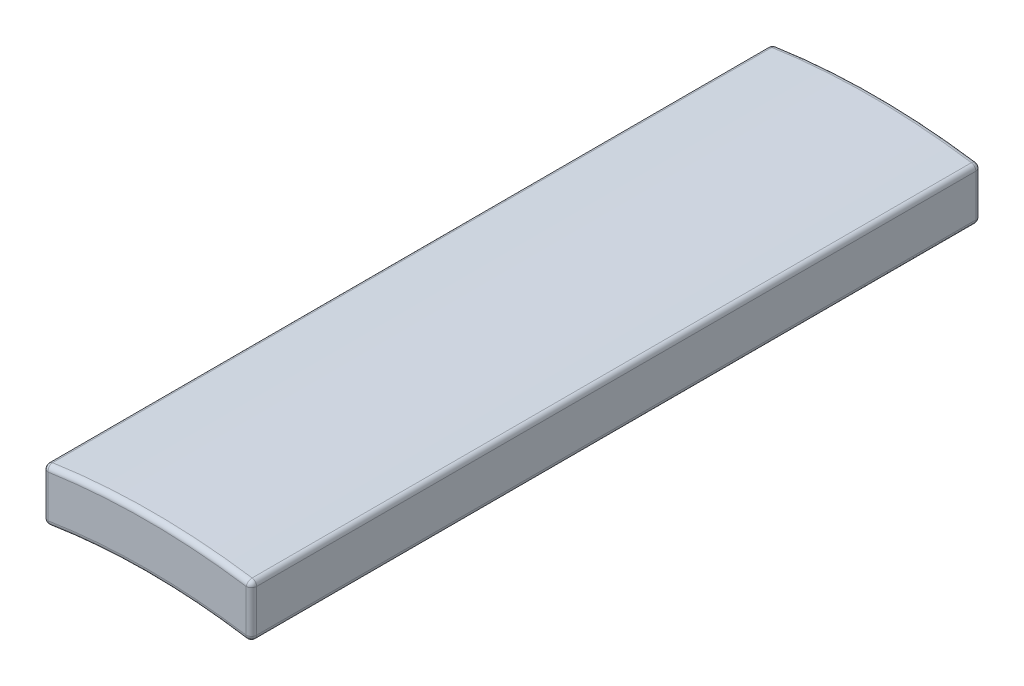
ISO-10303-21;
HEADER;
FILE_DESCRIPTION(('STEP AP214'),'2;1');
FILE_NAME('part.step','',(''),(''),'','','');
FILE_SCHEMA(('AUTOMOTIVE_DESIGN { 1 0 10303 214 1 1 1 1 }'));
ENDSEC;
DATA;
#1=APPLICATION_CONTEXT('core data for automotive mechanical design processes');
#2=APPLICATION_PROTOCOL_DEFINITION('international standard','automotive_design',2000,#1);
#3=PRODUCT_CONTEXT('',#1,'mechanical');
#4=PRODUCT('Part','Part','',(#3));
#5=PRODUCT_RELATED_PRODUCT_CATEGORY('part','',(#4));
#6=PRODUCT_DEFINITION_FORMATION('','',#4);
#7=PRODUCT_DEFINITION_CONTEXT('part definition',#1,'design');
#8=PRODUCT_DEFINITION('design','',#6,#7);
#9=PRODUCT_DEFINITION_SHAPE('','',#8);
#10=(LENGTH_UNIT() NAMED_UNIT(*) SI_UNIT(.MILLI.,.METRE.));
#11=(NAMED_UNIT(*) PLANE_ANGLE_UNIT() SI_UNIT($,.RADIAN.));
#12=(NAMED_UNIT(*) SI_UNIT($,.STERADIAN.) SOLID_ANGLE_UNIT());
#13=UNCERTAINTY_MEASURE_WITH_UNIT(LENGTH_MEASURE(1.E-05),#10,'distance_accuracy_value','');
#14=(GEOMETRIC_REPRESENTATION_CONTEXT(3) GLOBAL_UNCERTAINTY_ASSIGNED_CONTEXT((#13)) GLOBAL_UNIT_ASSIGNED_CONTEXT((#10,
#11,#12)) REPRESENTATION_CONTEXT('',''));
#15=CARTESIAN_POINT('',(0.,0.,0.));
#16=DIRECTION('',(0.,0.,1.));
#17=DIRECTION('',(1.,0.,0.));
#18=AXIS2_PLACEMENT_3D('',#15,#16,#17);
#19=CARTESIAN_POINT('',(0.,0.,14.));
#20=DIRECTION('',(0.,0.,-1.));
#21=DIRECTION('',(-1.,0.,0.));
#22=AXIS2_PLACEMENT_3D('',#19,#20,#21);
#23=CYLINDRICAL_SURFACE('',#22,12.);
#24=CARTESIAN_POINT('',(0.,0.,0.0999999999999994));
#25=DIRECTION('',(0.,0.,1.));
#26=DIRECTION('',(1.,0.,0.));
#27=AXIS2_PLACEMENT_3D('',#24,#25,#26);
#28=CIRCLE('',#27,12.);
#29=CARTESIAN_POINT('',(-1.88429752066116,11.8511359309406,0.0999999999999994));
#30=VERTEX_POINT('',#29);
#31=CARTESIAN_POINT('',(1.88429752066116,11.8511359309406,0.0999999999999994));
#32=VERTEX_POINT('',#31);
#33=EDGE_CURVE('E44',#30,#32,#28,.F.);
#34=ORIENTED_EDGE('',*,*,#33,.T.);
#35=DIRECTION('',(0.,0.,-1.));
#36=VECTOR('',#35,1.);
#37=CARTESIAN_POINT('',(1.88429752066116,11.8511359309406,14.));
#38=LINE('',#37,#36);
#39=CARTESIAN_POINT('',(1.88429752066116,11.8511359309406,13.9));
#40=VERTEX_POINT('',#39);
#41=EDGE_CURVE('E11',#32,#40,#38,.F.);
#42=ORIENTED_EDGE('',*,*,#41,.T.);
#43=CARTESIAN_POINT('',(0.,0.,13.9));
#44=DIRECTION('',(0.,0.,1.));
#45=DIRECTION('',(1.,0.,0.));
#46=AXIS2_PLACEMENT_3D('',#43,#44,#45);
#47=CIRCLE('',#46,12.);
#48=CARTESIAN_POINT('',(-1.88429752066116,11.8511359309406,13.9));
#49=VERTEX_POINT('',#48);
#50=EDGE_CURVE('E203',#40,#49,#47,.T.);
#51=ORIENTED_EDGE('',*,*,#50,.T.);
#52=DIRECTION('',(0.,0.,-1.));
#53=VECTOR('',#52,1.);
#54=CARTESIAN_POINT('',(-1.88429752066116,11.8511359309406,14.));
#55=LINE('',#54,#53);
#56=EDGE_CURVE('E201',#49,#30,#55,.T.);
#57=ORIENTED_EDGE('',*,*,#56,.T.);
#58=EDGE_LOOP('',(#34,#42,#51,#57));
#59=FACE_BOUND('',#58,.T.);
#60=ADVANCED_FACE('F35',(#59),#23,.F.);
#61=CARTESIAN_POINT('',(2.,11.8321595661992,14.));
#62=DIRECTION('',(-1.,0.,0.));
#63=DIRECTION('',(0.,0.,1.));
#64=AXIS2_PLACEMENT_3D('',#61,#62,#63);
#65=PLANE('',#64);
#66=DIRECTION('',(0.,1.,0.));
#67=VECTOR('',#66,1.);
#68=CARTESIAN_POINT('',(2.,11.8321595661992,0.0999999999999994));
#69=LINE('',#68,#67);
#70=CARTESIAN_POINT('',(2.,11.9498953970317,0.0999999999999994));
#71=VERTEX_POINT('',#70);
#72=CARTESIAN_POINT('',(2.,12.7593103261893,0.0999999999999994));
#73=VERTEX_POINT('',#72);
#74=EDGE_CURVE('E169',#71,#73,#69,.T.);
#75=ORIENTED_EDGE('',*,*,#74,.T.);
#76=DIRECTION('',(0.,0.,-1.));
#77=VECTOR('',#76,1.);
#78=CARTESIAN_POINT('',(2.,12.7593103261893,14.));
#79=LINE('',#78,#77);
#80=CARTESIAN_POINT('',(2.,12.7593103261893,13.9));
#81=VERTEX_POINT('',#80);
#82=EDGE_CURVE('E174',#73,#81,#79,.F.);
#83=ORIENTED_EDGE('',*,*,#82,.T.);
#84=DIRECTION('',(0.,1.,0.));
#85=VECTOR('',#84,1.);
#86=CARTESIAN_POINT('',(2.,11.8321595661992,13.9));
#87=LINE('',#86,#85);
#88=CARTESIAN_POINT('',(2.,11.9498953970317,13.9));
#89=VERTEX_POINT('',#88);
#90=EDGE_CURVE('E171',#81,#89,#87,.F.);
#91=ORIENTED_EDGE('',*,*,#90,.T.);
#92=DIRECTION('',(0.,0.,-1.));
#93=VECTOR('',#92,1.);
#94=CARTESIAN_POINT('',(2.,11.9498953970317,14.));
#95=LINE('',#94,#93);
#96=EDGE_CURVE('E167',#89,#71,#95,.T.);
#97=ORIENTED_EDGE('',*,*,#96,.T.);
#98=EDGE_LOOP('',(#75,#83,#91,#97));
#99=FACE_BOUND('',#98,.T.);
#100=ADVANCED_FACE('F286',(#99),#65,.F.);
#101=CARTESIAN_POINT('',(0.,0.,14.));
#102=DIRECTION('',(0.,0.,-1.));
#103=DIRECTION('',(-1.,0.,0.));
#104=AXIS2_PLACEMENT_3D('',#101,#102,#103);
#105=CYLINDRICAL_SURFACE('',#104,13.);
#106=CARTESIAN_POINT('',(0.,0.,13.9));
#107=DIRECTION('',(0.,0.,1.));
#108=DIRECTION('',(1.,0.,0.));
#109=AXIS2_PLACEMENT_3D('',#106,#107,#108);
#110=CIRCLE('',#109,13.);
#111=CARTESIAN_POINT('',(-1.91472868217054,12.8582197085628,13.9));
#112=VERTEX_POINT('',#111);
#113=CARTESIAN_POINT('',(1.91472868217054,12.8582197085628,13.9));
#114=VERTEX_POINT('',#113);
#115=EDGE_CURVE('E194',#112,#114,#110,.F.);
#116=ORIENTED_EDGE('',*,*,#115,.T.);
#117=DIRECTION('',(0.,0.,-1.));
#118=VECTOR('',#117,1.);
#119=CARTESIAN_POINT('',(1.91472868217054,12.8582197085628,14.));
#120=LINE('',#119,#118);
#121=CARTESIAN_POINT('',(1.91472868217054,12.8582197085628,0.0999999999999994));
#122=VERTEX_POINT('',#121);
#123=EDGE_CURVE('E199',#114,#122,#120,.T.);
#124=ORIENTED_EDGE('',*,*,#123,.T.);
#125=CARTESIAN_POINT('',(0.,0.,0.0999999999999994));
#126=DIRECTION('',(0.,0.,1.));
#127=DIRECTION('',(1.,0.,0.));
#128=AXIS2_PLACEMENT_3D('',#125,#126,#127);
#129=CIRCLE('',#128,13.);
#130=CARTESIAN_POINT('',(-1.91472868217054,12.8582197085628,0.0999999999999994));
#131=VERTEX_POINT('',#130);
#132=EDGE_CURVE('E196',#122,#131,#129,.T.);
#133=ORIENTED_EDGE('',*,*,#132,.T.);
#134=DIRECTION('',(0.,0.,-1.));
#135=VECTOR('',#134,1.);
#136=CARTESIAN_POINT('',(-1.91472868217054,12.8582197085628,14.));
#137=LINE('',#136,#135);
#138=EDGE_CURVE('E192',#131,#112,#137,.F.);
#139=ORIENTED_EDGE('',*,*,#138,.T.);
#140=EDGE_LOOP('',(#116,#124,#133,#139));
#141=FACE_BOUND('',#140,.T.);
#142=ADVANCED_FACE('F268',(#141),#105,.T.);
#143=CARTESIAN_POINT('',(-2.,11.8321595661992,14.));
#144=DIRECTION('',(1.,0.,0.));
#145=DIRECTION('',(0.,0.,-1.));
#146=AXIS2_PLACEMENT_3D('',#143,#144,#145);
#147=PLANE('',#146);
#148=DIRECTION('',(0.,-1.,0.));
#149=VECTOR('',#148,1.);
#150=CARTESIAN_POINT('',(-2.,12.8452325786651,13.9));
#151=LINE('',#150,#149);
#152=CARTESIAN_POINT('',(-2.,11.9498953970317,13.9));
#153=VERTEX_POINT('',#152);
#154=CARTESIAN_POINT('',(-2.,12.7593103261893,13.9));
#155=VERTEX_POINT('',#154);
#156=EDGE_CURVE('E143',#153,#155,#151,.F.);
#157=ORIENTED_EDGE('',*,*,#156,.T.);
#158=DIRECTION('',(0.,0.,-1.));
#159=VECTOR('',#158,1.);
#160=CARTESIAN_POINT('',(-2.,12.7593103261893,14.));
#161=LINE('',#160,#159);
#162=CARTESIAN_POINT('',(-2.,12.7593103261893,0.0999999999999994));
#163=VERTEX_POINT('',#162);
#164=EDGE_CURVE('E181',#155,#163,#161,.T.);
#165=ORIENTED_EDGE('',*,*,#164,.T.);
#166=DIRECTION('',(0.,-1.,0.));
#167=VECTOR('',#166,1.);
#168=CARTESIAN_POINT('',(-2.,11.8321595661992,0.0999999999999994));
#169=LINE('',#168,#167);
#170=CARTESIAN_POINT('',(-2.,11.9498953970317,0.0999999999999994));
#171=VERTEX_POINT('',#170);
#172=EDGE_CURVE('E178',#163,#171,#169,.T.);
#173=ORIENTED_EDGE('',*,*,#172,.T.);
#174=DIRECTION('',(0.,0.,-1.));
#175=VECTOR('',#174,1.);
#176=CARTESIAN_POINT('',(-2.,11.9498953970317,14.));
#177=LINE('',#176,#175);
#178=EDGE_CURVE('E176',#171,#153,#177,.F.);
#179=ORIENTED_EDGE('',*,*,#178,.T.);
#180=EDGE_LOOP('',(#157,#165,#173,#179));
#181=FACE_BOUND('',#180,.T.);
#182=ADVANCED_FACE('F307',(#181),#147,.F.);
#183=CARTESIAN_POINT('',(0.,0.,14.));
#184=DIRECTION('',(0.,0.,1.));
#185=DIRECTION('',(1.,0.,0.));
#186=AXIS2_PLACEMENT_3D('',#183,#184,#185);
#187=PLANE('',#186);
#188=DIRECTION('',(0.,1.,0.));
#189=VECTOR('',#188,1.);
#190=CARTESIAN_POINT('',(1.9,12.8452325786651,14.));
#191=LINE('',#190,#189);
#192=CARTESIAN_POINT('',(1.9,11.9498953970317,14.));
#193=VERTEX_POINT('',#192);
#194=CARTESIAN_POINT('',(1.9,12.7593103261893,14.));
#195=VERTEX_POINT('',#194);
#196=EDGE_CURVE('E135',#193,#195,#191,.T.);
#197=ORIENTED_EDGE('',*,*,#196,.T.);
#198=CARTESIAN_POINT('',(0.,0.,14.));
#199=DIRECTION('',(0.,0.,1.));
#200=DIRECTION('',(1.,0.,0.));
#201=AXIS2_PLACEMENT_3D('',#198,#199,#200);
#202=CIRCLE('',#201,12.9);
#203=CARTESIAN_POINT('',(-1.9,12.7593103261893,14.));
#204=VERTEX_POINT('',#203);
#205=EDGE_CURVE('E131',#195,#204,#202,.T.);
#206=ORIENTED_EDGE('',*,*,#205,.T.);
#207=DIRECTION('',(0.,-1.,0.));
#208=VECTOR('',#207,1.);
#209=CARTESIAN_POINT('',(-1.9,11.8321595661992,14.));
#210=LINE('',#209,#208);
#211=CARTESIAN_POINT('',(-1.9,11.9498953970317,14.));
#212=VERTEX_POINT('',#211);
#213=EDGE_CURVE('E123',#204,#212,#210,.T.);
#214=ORIENTED_EDGE('',*,*,#213,.T.);
#215=CARTESIAN_POINT('',(0.,0.,14.));
#216=DIRECTION('',(0.,0.,1.));
#217=DIRECTION('',(1.,0.,0.));
#218=AXIS2_PLACEMENT_3D('',#215,#216,#217);
#219=CIRCLE('',#218,12.1);
#220=EDGE_CURVE('E128',#212,#193,#219,.F.);
#221=ORIENTED_EDGE('',*,*,#220,.T.);
#222=EDGE_LOOP('',(#197,#206,#214,#221));
#223=FACE_BOUND('',#222,.T.);
#224=ADVANCED_FACE('F126',(#223),#187,.T.);
#225=CARTESIAN_POINT('',(0.,0.,0.));
#226=DIRECTION('',(0.,0.,1.));
#227=DIRECTION('',(1.,0.,0.));
#228=AXIS2_PLACEMENT_3D('',#225,#226,#227);
#229=PLANE('',#228);
#230=DIRECTION('',(0.,-1.,0.));
#231=VECTOR('',#230,1.);
#232=CARTESIAN_POINT('',(-1.9,0.,0.));
#233=LINE('',#232,#231);
#234=CARTESIAN_POINT('',(-1.9,11.9498953970317,0.));
#235=VERTEX_POINT('',#234);
#236=CARTESIAN_POINT('',(-1.9,12.7593103261893,0.));
#237=VERTEX_POINT('',#236);
#238=EDGE_CURVE('E187',#235,#237,#233,.F.);
#239=ORIENTED_EDGE('',*,*,#238,.T.);
#240=CARTESIAN_POINT('',(0.,0.,0.));
#241=DIRECTION('',(0.,0.,1.));
#242=DIRECTION('',(1.,0.,0.));
#243=AXIS2_PLACEMENT_3D('',#240,#241,#242);
#244=CIRCLE('',#243,12.9);
#245=CARTESIAN_POINT('',(1.9,12.7593103261893,0.));
#246=VERTEX_POINT('',#245);
#247=EDGE_CURVE('E190',#237,#246,#244,.F.);
#248=ORIENTED_EDGE('',*,*,#247,.T.);
#249=DIRECTION('',(0.,1.,0.));
#250=VECTOR('',#249,1.);
#251=CARTESIAN_POINT('',(1.9,0.,0.));
#252=LINE('',#251,#250);
#253=CARTESIAN_POINT('',(1.9,11.9498953970317,0.));
#254=VERTEX_POINT('',#253);
#255=EDGE_CURVE('E185',#246,#254,#252,.F.);
#256=ORIENTED_EDGE('',*,*,#255,.T.);
#257=CARTESIAN_POINT('',(0.,0.,0.));
#258=DIRECTION('',(0.,0.,1.));
#259=DIRECTION('',(1.,0.,0.));
#260=AXIS2_PLACEMENT_3D('',#257,#258,#259);
#261=CIRCLE('',#260,12.1);
#262=EDGE_CURVE('E183',#254,#235,#261,.T.);
#263=ORIENTED_EDGE('',*,*,#262,.T.);
#264=EDGE_LOOP('',(#239,#248,#256,#263));
#265=FACE_BOUND('',#264,.T.);
#266=ADVANCED_FACE('F295',(#265),#229,.F.);
#267=CARTESIAN_POINT('',(-1.9,11.8321595661992,0.0999999999999994));
#268=DIRECTION('',(0.,-1.,0.));
#269=DIRECTION('',(0.,0.,-1.));
#270=AXIS2_PLACEMENT_3D('',#267,#268,#269);
#271=CYLINDRICAL_SURFACE('',#270,0.1);
#272=CARTESIAN_POINT('',(-1.9,11.9498953970317,0.0999999999999994));
#273=DIRECTION('',(0.,-1.,0.));
#274=DIRECTION('',(0.,0.,-1.));
#275=AXIS2_PLACEMENT_3D('',#272,#273,#274);
#276=CIRCLE('',#275,0.1);
#277=EDGE_CURVE('E39',#171,#235,#276,.T.);
#278=ORIENTED_EDGE('',*,*,#277,.F.);
#279=ORIENTED_EDGE('',*,*,#172,.F.);
#280=CARTESIAN_POINT('',(-1.9,12.7593103261893,0.1));
#281=DIRECTION('',(0.,1.,0.));
#282=DIRECTION('',(0.,0.,1.));
#283=AXIS2_PLACEMENT_3D('',#280,#281,#282);
#284=CIRCLE('',#283,0.1);
#285=EDGE_CURVE('E163',#237,#163,#284,.T.);
#286=ORIENTED_EDGE('',*,*,#285,.F.);
#287=ORIENTED_EDGE('',*,*,#238,.F.);
#288=EDGE_LOOP('',(#278,#279,#286,#287));
#289=FACE_BOUND('',#288,.T.);
#290=ADVANCED_FACE('F37',(#289),#271,.T.);
#291=CARTESIAN_POINT('',(-1.9,11.9498953970317,0.1));
#292=DIRECTION('',(0.,0.,1.));
#293=DIRECTION('',(1.,0.,0.));
#294=AXIS2_PLACEMENT_3D('',#291,#292,#293);
#295=SPHERICAL_SURFACE('',#294,0.1);
#296=CARTESIAN_POINT('',(-1.9,11.9498953970317,0.0999999999999994));
#297=DIRECTION('',(0.,0.,-1.));
#298=DIRECTION('',(-1.,0.,0.));
#299=AXIS2_PLACEMENT_3D('',#296,#297,#298);
#300=CIRCLE('',#299,0.1);
#301=EDGE_CURVE('E248',#171,#30,#300,.F.);
#302=ORIENTED_EDGE('',*,*,#301,.F.);
#303=ORIENTED_EDGE('',*,*,#277,.T.);
#304=CARTESIAN_POINT('',(-1.9,11.9498953970317,0.1));
#305=DIRECTION('',(-0.987594660911713,-0.15702479338843,0.));
#306=DIRECTION('',(0.15702479338843,-0.987594660911713,0.));
#307=AXIS2_PLACEMENT_3D('',#304,#305,#306);
#308=CIRCLE('',#307,0.1);
#309=EDGE_CURVE('E251',#30,#235,#308,.F.);
#310=ORIENTED_EDGE('',*,*,#309,.F.);
#311=EDGE_LOOP('',(#302,#303,#310));
#312=FACE_BOUND('',#311,.T.);
#313=ADVANCED_FACE('F303',(#312),#295,.T.);
#314=CARTESIAN_POINT('',(-1.9,12.7593103261893,0.1));
#315=DIRECTION('',(0.,0.,1.));
#316=DIRECTION('',(1.,0.,0.));
#317=AXIS2_PLACEMENT_3D('',#314,#315,#316);
#318=SPHERICAL_SURFACE('',#317,0.1);
#319=CARTESIAN_POINT('',(-1.9,12.7593103261893,0.0999999999999994));
#320=DIRECTION('',(-0.989093823735602,-0.147286821705427,0.));
#321=DIRECTION('',(0.147286821705427,-0.989093823735602,0.));
#322=AXIS2_PLACEMENT_3D('',#319,#320,#321);
#323=CIRCLE('',#322,0.1);
#324=EDGE_CURVE('E242',#237,#131,#323,.F.);
#325=ORIENTED_EDGE('',*,*,#324,.F.);
#326=ORIENTED_EDGE('',*,*,#285,.T.);
#327=CARTESIAN_POINT('',(-1.9,12.7593103261893,0.0999999999999994));
#328=DIRECTION('',(0.,0.,-1.));
#329=DIRECTION('',(-1.,0.,0.));
#330=AXIS2_PLACEMENT_3D('',#327,#328,#329);
#331=CIRCLE('',#330,0.1);
#332=EDGE_CURVE('E245',#131,#163,#331,.F.);
#333=ORIENTED_EDGE('',*,*,#332,.F.);
#334=EDGE_LOOP('',(#325,#326,#333));
#335=FACE_BOUND('',#334,.T.);
#336=ADVANCED_FACE('F258',(#335),#318,.T.);
#337=CARTESIAN_POINT('',(0.,0.,0.0999999999999994));
#338=DIRECTION('',(0.,0.,1.));
#339=DIRECTION('',(1.,0.,0.));
#340=AXIS2_PLACEMENT_3D('',#337,#338,#339);
#341=TOROIDAL_SURFACE('',#340,12.1,0.1);
#342=ORIENTED_EDGE('',*,*,#309,.T.);
#343=ORIENTED_EDGE('',*,*,#262,.F.);
#344=CARTESIAN_POINT('',(1.9,11.9498953970317,0.0999999999999994));
#345=DIRECTION('',(0.987594660911713,-0.15702479338843,0.));
#346=DIRECTION('',(0.15702479338843,0.987594660911713,0.));
#347=AXIS2_PLACEMENT_3D('',#344,#345,#346);
#348=CIRCLE('',#347,0.1);
#349=EDGE_CURVE('E236',#32,#254,#348,.T.);
#350=ORIENTED_EDGE('',*,*,#349,.F.);
#351=ORIENTED_EDGE('',*,*,#33,.F.);
#352=EDGE_LOOP('',(#342,#343,#350,#351));
#353=FACE_BOUND('',#352,.T.);
#354=ADVANCED_FACE('F298',(#353),#341,.T.);
#355=CARTESIAN_POINT('',(-1.9,11.9498953970317,14.));
#356=DIRECTION('',(0.,0.,-1.));
#357=DIRECTION('',(-1.,0.,0.));
#358=AXIS2_PLACEMENT_3D('',#355,#356,#357);
#359=CYLINDRICAL_SURFACE('',#358,0.1);
#360=ORIENTED_EDGE('',*,*,#301,.T.);
#361=ORIENTED_EDGE('',*,*,#56,.F.);
#362=CARTESIAN_POINT('',(-1.9,11.9498953970317,13.9));
#363=DIRECTION('',(0.,0.,1.));
#364=DIRECTION('',(1.,0.,0.));
#365=AXIS2_PLACEMENT_3D('',#362,#363,#364);
#366=CIRCLE('',#365,0.1);
#367=EDGE_CURVE('E147',#153,#49,#366,.T.);
#368=ORIENTED_EDGE('',*,*,#367,.F.);
#369=ORIENTED_EDGE('',*,*,#178,.F.);
#370=EDGE_LOOP('',(#360,#361,#368,#369));
#371=FACE_BOUND('',#370,.T.);
#372=ADVANCED_FACE('F309',(#371),#359,.T.);
#373=CARTESIAN_POINT('',(-1.9,0.,13.9));
#374=DIRECTION('',(0.,1.,0.));
#375=DIRECTION('',(0.,0.,1.));
#376=AXIS2_PLACEMENT_3D('',#373,#374,#375);
#377=CYLINDRICAL_SURFACE('',#376,0.1);
#378=CARTESIAN_POINT('',(-1.9,12.7593103261893,13.9));
#379=DIRECTION('',(0.,1.,0.));
#380=DIRECTION('',(0.,0.,1.));
#381=AXIS2_PLACEMENT_3D('',#378,#379,#380);
#382=CIRCLE('',#381,0.1);
#383=EDGE_CURVE('E148',#155,#204,#382,.T.);
#384=ORIENTED_EDGE('',*,*,#383,.F.);
#385=ORIENTED_EDGE('',*,*,#156,.F.);
#386=CARTESIAN_POINT('',(-1.9,11.9498953970317,13.9));
#387=DIRECTION('',(0.,-1.,0.));
#388=DIRECTION('',(0.,0.,-1.));
#389=AXIS2_PLACEMENT_3D('',#386,#387,#388);
#390=CIRCLE('',#389,0.1);
#391=EDGE_CURVE('E139',#212,#153,#390,.T.);
#392=ORIENTED_EDGE('',*,*,#391,.F.);
#393=ORIENTED_EDGE('',*,*,#213,.F.);
#394=EDGE_LOOP('',(#384,#385,#392,#393));
#395=FACE_BOUND('',#394,.T.);
#396=ADVANCED_FACE('F141',(#395),#377,.T.);
#397=CARTESIAN_POINT('',(-1.9,12.7593103261893,14.));
#398=DIRECTION('',(0.,0.,-1.));
#399=DIRECTION('',(-1.,0.,0.));
#400=AXIS2_PLACEMENT_3D('',#397,#398,#399);
#401=CYLINDRICAL_SURFACE('',#400,0.1);
#402=ORIENTED_EDGE('',*,*,#332,.T.);
#403=ORIENTED_EDGE('',*,*,#164,.F.);
#404=CARTESIAN_POINT('',(-1.9,12.7593103261893,13.9));
#405=DIRECTION('',(0.,0.,1.));
#406=DIRECTION('',(1.,0.,0.));
#407=AXIS2_PLACEMENT_3D('',#404,#405,#406);
#408=CIRCLE('',#407,0.1);
#409=EDGE_CURVE('E232',#112,#155,#408,.T.);
#410=ORIENTED_EDGE('',*,*,#409,.F.);
#411=ORIENTED_EDGE('',*,*,#138,.F.);
#412=EDGE_LOOP('',(#402,#403,#410,#411));
#413=FACE_BOUND('',#412,.T.);
#414=ADVANCED_FACE('F264',(#413),#401,.T.);
#415=CARTESIAN_POINT('',(0.,0.,0.0999999999999994));
#416=DIRECTION('',(0.,0.,1.));
#417=DIRECTION('',(1.,0.,0.));
#418=AXIS2_PLACEMENT_3D('',#415,#416,#417);
#419=TOROIDAL_SURFACE('',#418,12.9,0.1);
#420=ORIENTED_EDGE('',*,*,#324,.T.);
#421=ORIENTED_EDGE('',*,*,#132,.F.);
#422=CARTESIAN_POINT('',(1.9,12.7593103261893,0.1));
#423=DIRECTION('',(0.989093823735602,-0.147286821705425,0.));
#424=DIRECTION('',(0.147286821705425,0.989093823735602,0.));
#425=AXIS2_PLACEMENT_3D('',#422,#423,#424);
#426=CIRCLE('',#425,0.1);
#427=EDGE_CURVE('E229',#246,#122,#426,.T.);
#428=ORIENTED_EDGE('',*,*,#427,.F.);
#429=ORIENTED_EDGE('',*,*,#247,.F.);
#430=EDGE_LOOP('',(#420,#421,#428,#429));
#431=FACE_BOUND('',#430,.T.);
#432=ADVANCED_FACE('F274',(#431),#419,.T.);
#433=CARTESIAN_POINT('',(1.9,11.8321595661992,0.0999999999999994));
#434=DIRECTION('',(0.,1.,0.));
#435=DIRECTION('',(0.,0.,1.));
#436=AXIS2_PLACEMENT_3D('',#433,#434,#435);
#437=CYLINDRICAL_SURFACE('',#436,0.1);
#438=CARTESIAN_POINT('',(1.9,11.9498953970317,0.1));
#439=DIRECTION('',(0.,-1.,0.));
#440=DIRECTION('',(0.,0.,-1.));
#441=AXIS2_PLACEMENT_3D('',#438,#439,#440);
#442=CIRCLE('',#441,0.1);
#443=EDGE_CURVE('E239',#254,#71,#442,.T.);
#444=ORIENTED_EDGE('',*,*,#443,.F.);
#445=ORIENTED_EDGE('',*,*,#255,.F.);
#446=CARTESIAN_POINT('',(1.9,12.7593103261893,0.0999999999999994));
#447=DIRECTION('',(0.,1.,0.));
#448=DIRECTION('',(0.,0.,1.));
#449=AXIS2_PLACEMENT_3D('',#446,#447,#448);
#450=CIRCLE('',#449,0.1);
#451=EDGE_CURVE('E226',#73,#246,#450,.T.);
#452=ORIENTED_EDGE('',*,*,#451,.F.);
#453=ORIENTED_EDGE('',*,*,#74,.F.);
#454=EDGE_LOOP('',(#444,#445,#452,#453));
#455=FACE_BOUND('',#454,.T.);
#456=ADVANCED_FACE('F292',(#455),#437,.T.);
#457=CARTESIAN_POINT('',(1.9,11.9498953970317,0.1));
#458=DIRECTION('',(0.,0.,1.));
#459=DIRECTION('',(1.,0.,0.));
#460=AXIS2_PLACEMENT_3D('',#457,#458,#459);
#461=SPHERICAL_SURFACE('',#460,0.1);
#462=ORIENTED_EDGE('',*,*,#349,.T.);
#463=ORIENTED_EDGE('',*,*,#443,.T.);
#464=CARTESIAN_POINT('',(1.9,11.9498953970317,0.0999999999999994));
#465=DIRECTION('',(0.,0.,-1.));
#466=DIRECTION('',(-1.,0.,0.));
#467=AXIS2_PLACEMENT_3D('',#464,#465,#466);
#468=CIRCLE('',#467,0.1);
#469=EDGE_CURVE('E154',#32,#71,#468,.F.);
#470=ORIENTED_EDGE('',*,*,#469,.F.);
#471=EDGE_LOOP('',(#462,#463,#470));
#472=FACE_BOUND('',#471,.T.);
#473=ADVANCED_FACE('F331',(#472),#461,.T.);
#474=CARTESIAN_POINT('',(-1.9,11.9498953970317,13.9));
#475=DIRECTION('',(0.,0.,1.));
#476=DIRECTION('',(1.,0.,0.));
#477=AXIS2_PLACEMENT_3D('',#474,#475,#476);
#478=SPHERICAL_SURFACE('',#477,0.1);
#479=ORIENTED_EDGE('',*,*,#391,.T.);
#480=ORIENTED_EDGE('',*,*,#367,.T.);
#481=CARTESIAN_POINT('',(-1.9,11.9498953970317,13.9));
#482=DIRECTION('',(-0.987594660911713,-0.15702479338843,0.));
#483=DIRECTION('',(0.15702479338843,-0.987594660911713,0.));
#484=AXIS2_PLACEMENT_3D('',#481,#482,#483);
#485=CIRCLE('',#484,0.1);
#486=EDGE_CURVE('E151',#212,#49,#485,.F.);
#487=ORIENTED_EDGE('',*,*,#486,.F.);
#488=EDGE_LOOP('',(#479,#480,#487));
#489=FACE_BOUND('',#488,.T.);
#490=ADVANCED_FACE('F152',(#489),#478,.T.);
#491=CARTESIAN_POINT('',(-1.9,12.7593103261893,13.9));
#492=DIRECTION('',(0.,0.,1.));
#493=DIRECTION('',(1.,0.,0.));
#494=AXIS2_PLACEMENT_3D('',#491,#492,#493);
#495=SPHERICAL_SURFACE('',#494,0.1);
#496=ORIENTED_EDGE('',*,*,#409,.T.);
#497=ORIENTED_EDGE('',*,*,#383,.T.);
#498=CARTESIAN_POINT('',(-1.9,12.7593103261893,13.9));
#499=DIRECTION('',(-0.989093823735602,-0.147286821705425,0.));
#500=DIRECTION('',(0.147286821705425,-0.989093823735602,0.));
#501=AXIS2_PLACEMENT_3D('',#498,#499,#500);
#502=CIRCLE('',#501,0.1);
#503=EDGE_CURVE('E155',#112,#204,#502,.F.);
#504=ORIENTED_EDGE('',*,*,#503,.F.);
#505=EDGE_LOOP('',(#496,#497,#504));
#506=FACE_BOUND('',#505,.T.);
#507=ADVANCED_FACE('F323',(#506),#495,.T.);
#508=CARTESIAN_POINT('',(1.9,12.7593103261893,0.1));
#509=DIRECTION('',(0.,0.,1.));
#510=DIRECTION('',(1.,0.,0.));
#511=AXIS2_PLACEMENT_3D('',#508,#509,#510);
#512=SPHERICAL_SURFACE('',#511,0.1);
#513=ORIENTED_EDGE('',*,*,#451,.T.);
#514=ORIENTED_EDGE('',*,*,#427,.T.);
#515=CARTESIAN_POINT('',(1.9,12.7593103261893,0.0999999999999994));
#516=DIRECTION('',(0.,0.,-1.));
#517=DIRECTION('',(-1.,0.,0.));
#518=AXIS2_PLACEMENT_3D('',#515,#516,#517);
#519=CIRCLE('',#518,0.1);
#520=EDGE_CURVE('E220',#73,#122,#519,.F.);
#521=ORIENTED_EDGE('',*,*,#520,.F.);
#522=EDGE_LOOP('',(#513,#514,#521));
#523=FACE_BOUND('',#522,.T.);
#524=ADVANCED_FACE('F277',(#523),#512,.T.);
#525=CARTESIAN_POINT('',(1.9,11.9498953970317,14.));
#526=DIRECTION('',(0.,0.,-1.));
#527=DIRECTION('',(-1.,0.,0.));
#528=AXIS2_PLACEMENT_3D('',#525,#526,#527);
#529=CYLINDRICAL_SURFACE('',#528,0.1);
#530=ORIENTED_EDGE('',*,*,#469,.T.);
#531=ORIENTED_EDGE('',*,*,#96,.F.);
#532=CARTESIAN_POINT('',(1.9,11.9498953970317,13.9));
#533=DIRECTION('',(0.,0.,1.));
#534=DIRECTION('',(1.,0.,0.));
#535=AXIS2_PLACEMENT_3D('',#532,#533,#534);
#536=CIRCLE('',#535,0.1);
#537=EDGE_CURVE('E217',#40,#89,#536,.T.);
#538=ORIENTED_EDGE('',*,*,#537,.F.);
#539=ORIENTED_EDGE('',*,*,#41,.F.);
#540=EDGE_LOOP('',(#530,#531,#538,#539));
#541=FACE_BOUND('',#540,.T.);
#542=ADVANCED_FACE('F311',(#541),#529,.T.);
#543=CARTESIAN_POINT('',(0.,0.,13.9));
#544=DIRECTION('',(0.,0.,1.));
#545=DIRECTION('',(1.,0.,0.));
#546=AXIS2_PLACEMENT_3D('',#543,#544,#545);
#547=TOROIDAL_SURFACE('',#546,12.1,0.1);
#548=ORIENTED_EDGE('',*,*,#486,.T.);
#549=ORIENTED_EDGE('',*,*,#50,.F.);
#550=CARTESIAN_POINT('',(1.9,11.9498953970317,13.9));
#551=DIRECTION('',(0.987594660911713,-0.15702479338843,0.));
#552=DIRECTION('',(0.15702479338843,0.987594660911713,0.));
#553=AXIS2_PLACEMENT_3D('',#550,#551,#552);
#554=CIRCLE('',#553,0.1);
#555=EDGE_CURVE('E159',#193,#40,#554,.T.);
#556=ORIENTED_EDGE('',*,*,#555,.F.);
#557=ORIENTED_EDGE('',*,*,#220,.F.);
#558=EDGE_LOOP('',(#548,#549,#556,#557));
#559=FACE_BOUND('',#558,.T.);
#560=ADVANCED_FACE('F157',(#559),#547,.T.);
#561=CARTESIAN_POINT('',(0.,0.,13.9));
#562=DIRECTION('',(0.,0.,1.));
#563=DIRECTION('',(1.,0.,0.));
#564=AXIS2_PLACEMENT_3D('',#561,#562,#563);
#565=TOROIDAL_SURFACE('',#564,12.9,0.1);
#566=ORIENTED_EDGE('',*,*,#503,.T.);
#567=ORIENTED_EDGE('',*,*,#205,.F.);
#568=CARTESIAN_POINT('',(1.9,12.7593103261893,13.9));
#569=DIRECTION('',(0.989093823735602,-0.147286821705427,0.));
#570=DIRECTION('',(0.147286821705427,0.989093823735602,0.));
#571=AXIS2_PLACEMENT_3D('',#568,#569,#570);
#572=CIRCLE('',#571,0.1);
#573=EDGE_CURVE('E213',#114,#195,#572,.T.);
#574=ORIENTED_EDGE('',*,*,#573,.F.);
#575=ORIENTED_EDGE('',*,*,#115,.F.);
#576=EDGE_LOOP('',(#566,#567,#574,#575));
#577=FACE_BOUND('',#576,.T.);
#578=ADVANCED_FACE('F321',(#577),#565,.T.);
#579=CARTESIAN_POINT('',(1.9,12.7593103261893,14.));
#580=DIRECTION('',(0.,0.,-1.));
#581=DIRECTION('',(-1.,0.,0.));
#582=AXIS2_PLACEMENT_3D('',#579,#580,#581);
#583=CYLINDRICAL_SURFACE('',#582,0.1);
#584=ORIENTED_EDGE('',*,*,#520,.T.);
#585=ORIENTED_EDGE('',*,*,#123,.F.);
#586=CARTESIAN_POINT('',(1.9,12.7593103261893,13.9));
#587=DIRECTION('',(0.,0.,1.));
#588=DIRECTION('',(1.,0.,0.));
#589=AXIS2_PLACEMENT_3D('',#586,#587,#588);
#590=CIRCLE('',#589,0.1);
#591=EDGE_CURVE('E210',#81,#114,#590,.T.);
#592=ORIENTED_EDGE('',*,*,#591,.F.);
#593=ORIENTED_EDGE('',*,*,#82,.F.);
#594=EDGE_LOOP('',(#584,#585,#592,#593));
#595=FACE_BOUND('',#594,.T.);
#596=ADVANCED_FACE('F281',(#595),#583,.T.);
#597=CARTESIAN_POINT('',(1.9,11.9498953970317,13.9));
#598=DIRECTION('',(0.,0.,1.));
#599=DIRECTION('',(1.,0.,0.));
#600=AXIS2_PLACEMENT_3D('',#597,#598,#599);
#601=SPHERICAL_SURFACE('',#600,0.1);
#602=ORIENTED_EDGE('',*,*,#555,.T.);
#603=ORIENTED_EDGE('',*,*,#537,.T.);
#604=CARTESIAN_POINT('',(1.9,11.9498953970317,13.9));
#605=DIRECTION('',(0.,-1.,0.));
#606=DIRECTION('',(0.,0.,-1.));
#607=AXIS2_PLACEMENT_3D('',#604,#605,#606);
#608=CIRCLE('',#607,0.1);
#609=EDGE_CURVE('E208',#193,#89,#608,.F.);
#610=ORIENTED_EDGE('',*,*,#609,.F.);
#611=EDGE_LOOP('',(#602,#603,#610));
#612=FACE_BOUND('',#611,.T.);
#613=ADVANCED_FACE('F313',(#612),#601,.T.);
#614=CARTESIAN_POINT('',(1.9,12.7593103261893,13.9));
#615=DIRECTION('',(0.,0.,1.));
#616=DIRECTION('',(1.,0.,0.));
#617=AXIS2_PLACEMENT_3D('',#614,#615,#616);
#618=SPHERICAL_SURFACE('',#617,0.1);
#619=ORIENTED_EDGE('',*,*,#591,.T.);
#620=ORIENTED_EDGE('',*,*,#573,.T.);
#621=CARTESIAN_POINT('',(1.9,12.7593103261893,13.9));
#622=DIRECTION('',(0.,1.,0.));
#623=DIRECTION('',(0.,0.,1.));
#624=AXIS2_PLACEMENT_3D('',#621,#622,#623);
#625=CIRCLE('',#624,0.1);
#626=EDGE_CURVE('E206',#81,#195,#625,.F.);
#627=ORIENTED_EDGE('',*,*,#626,.F.);
#628=EDGE_LOOP('',(#619,#620,#627));
#629=FACE_BOUND('',#628,.T.);
#630=ADVANCED_FACE('F319',(#629),#618,.T.);
#631=CARTESIAN_POINT('',(1.9,0.,13.9));
#632=DIRECTION('',(0.,-1.,0.));
#633=DIRECTION('',(0.,0.,-1.));
#634=AXIS2_PLACEMENT_3D('',#631,#632,#633);
#635=CYLINDRICAL_SURFACE('',#634,0.1);
#636=ORIENTED_EDGE('',*,*,#609,.T.);
#637=ORIENTED_EDGE('',*,*,#90,.F.);
#638=ORIENTED_EDGE('',*,*,#626,.T.);
#639=ORIENTED_EDGE('',*,*,#196,.F.);
#640=EDGE_LOOP('',(#636,#637,#638,#639));
#641=FACE_BOUND('',#640,.T.);
#642=ADVANCED_FACE('F316',(#641),#635,.T.);
#643=CLOSED_SHELL('',(#60,#100,#142,#182,#224,#266,#290,#313,#336,#354,#372,#396,#414,#432,#456,
#473,#490,#507,#524,#542,#560,#578,#596,#613,#630,#642));
#644=MANIFOLD_SOLID_BREP('B2',#643);
#645=ADVANCED_BREP_SHAPE_REPRESENTATION('',(#18,#644),#14);
#646=SHAPE_DEFINITION_REPRESENTATION(#9,#645);
ENDSEC;
END-ISO-10303-21;
